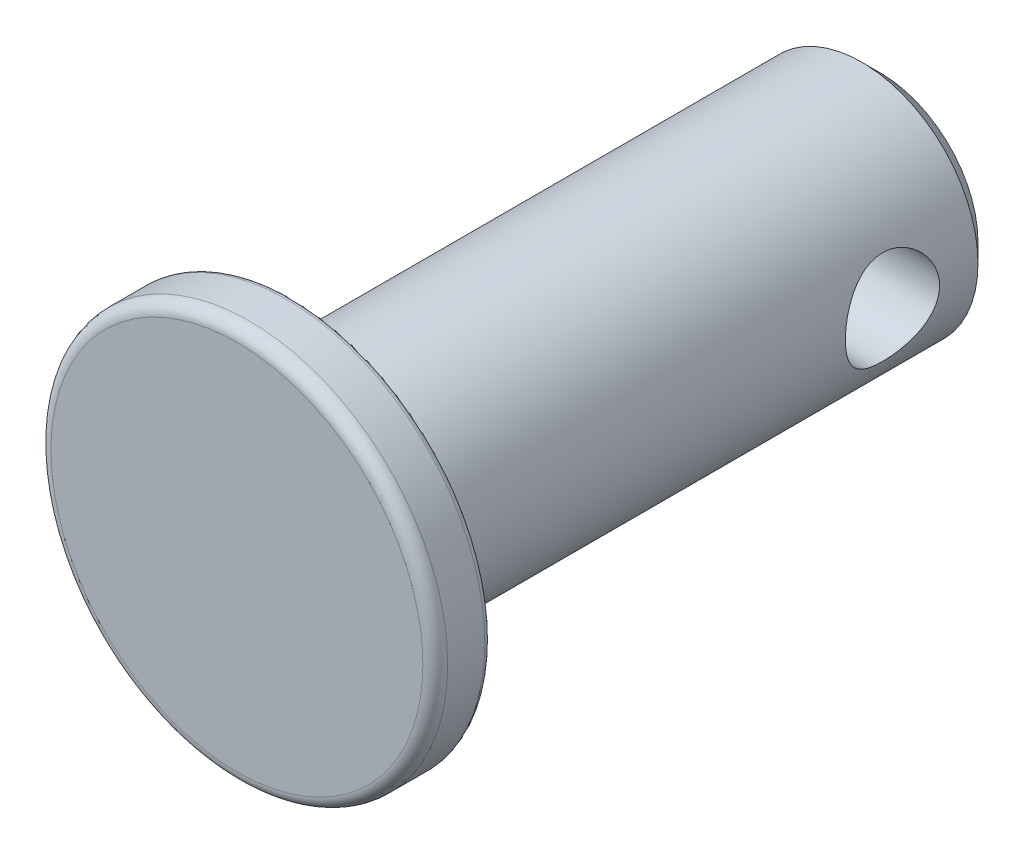
ISO-10303-21;
HEADER;
FILE_DESCRIPTION(('STEP AP214'),'2;1');
FILE_NAME('part.step','',(''),(''),'','','');
FILE_SCHEMA(('AUTOMOTIVE_DESIGN { 1 0 10303 214 1 1 1 1 }'));
ENDSEC;
DATA;
#1=APPLICATION_CONTEXT('core data for automotive mechanical design processes');
#2=APPLICATION_PROTOCOL_DEFINITION('international standard','automotive_design',2000,#1);
#3=PRODUCT_CONTEXT('',#1,'mechanical');
#4=PRODUCT('Part','Part','',(#3));
#5=PRODUCT_RELATED_PRODUCT_CATEGORY('part','',(#4));
#6=PRODUCT_DEFINITION_FORMATION('','',#4);
#7=PRODUCT_DEFINITION_CONTEXT('part definition',#1,'design');
#8=PRODUCT_DEFINITION('design','',#6,#7);
#9=PRODUCT_DEFINITION_SHAPE('','',#8);
#10=(LENGTH_UNIT() NAMED_UNIT(*) SI_UNIT(.MILLI.,.METRE.));
#11=(NAMED_UNIT(*) PLANE_ANGLE_UNIT() SI_UNIT($,.RADIAN.));
#12=(NAMED_UNIT(*) SI_UNIT($,.STERADIAN.) SOLID_ANGLE_UNIT());
#13=UNCERTAINTY_MEASURE_WITH_UNIT(LENGTH_MEASURE(1.E-05),#10,'distance_accuracy_value','');
#14=(GEOMETRIC_REPRESENTATION_CONTEXT(3) GLOBAL_UNCERTAINTY_ASSIGNED_CONTEXT((#13)) GLOBAL_UNIT_ASSIGNED_CONTEXT((#10,
#11,#12)) REPRESENTATION_CONTEXT('',''));
#15=CARTESIAN_POINT('',(0.,0.,0.));
#16=DIRECTION('',(0.,0.,1.));
#17=DIRECTION('',(1.,0.,0.));
#18=AXIS2_PLACEMENT_3D('',#15,#16,#17);
#19=CARTESIAN_POINT('',(0.,2.00025,-13.1826));
#20=DIRECTION('',(0.,0.,1.));
#21=DIRECTION('',(1.,0.,0.));
#22=AXIS2_PLACEMENT_3D('',#19,#20,#21);
#23=PLANE('',#22);
#24=CARTESIAN_POINT('',(0.,0.,-13.1826));
#25=DIRECTION('',(0.,0.,1.));
#26=DIRECTION('',(1.,0.,0.));
#27=AXIS2_PLACEMENT_3D('',#24,#25,#26);
#28=CIRCLE('',#27,2.00025);
#29=CARTESIAN_POINT('',(2.00025,0.,-13.1826));
#30=VERTEX_POINT('',#29);
#31=EDGE_CURVE('E10',#30,#30,#28,.T.);
#32=ORIENTED_EDGE('',*,*,#31,.F.);
#33=EDGE_LOOP('',(#32));
#34=FACE_BOUND('',#33,.T.);
#35=ADVANCED_FACE('F33',(#34),#23,.F.);
#36=CARTESIAN_POINT('',(0.,0.,-13.1826));
#37=DIRECTION('',(0.,0.,1.));
#38=DIRECTION('',(1.,0.,0.));
#39=AXIS2_PLACEMENT_3D('',#36,#37,#38);
#40=CONICAL_SURFACE('',#39,2.00025,0.785398163397444);
#41=CARTESIAN_POINT('',(0.,0.,-12.8016));
#42=DIRECTION('',(0.,0.,1.));
#43=DIRECTION('',(1.,0.,0.));
#44=AXIS2_PLACEMENT_3D('',#41,#42,#43);
#45=CIRCLE('',#44,2.38125);
#46=CARTESIAN_POINT('',(2.38125,0.,-12.8016));
#47=VERTEX_POINT('',#46);
#48=EDGE_CURVE('E44',#47,#47,#45,.T.);
#49=ORIENTED_EDGE('',*,*,#48,.F.);
#50=EDGE_LOOP('',(#49));
#51=FACE_BOUND('',#50,.T.);
#52=ORIENTED_EDGE('',*,*,#31,.T.);
#53=EDGE_LOOP('',(#52));
#54=FACE_BOUND('',#53,.T.);
#55=ADVANCED_FACE('F86',(#51,#54),#40,.T.);
#56=CARTESIAN_POINT('',(0.,0.,0.));
#57=DIRECTION('',(0.,0.,1.));
#58=DIRECTION('',(1.,0.,0.));
#59=AXIS2_PLACEMENT_3D('',#56,#57,#58);
#60=CYLINDRICAL_SURFACE('',#59,2.38125);
#61=CARTESIAN_POINT('',(2.38125,0.,-12.0142));
#62=CARTESIAN_POINT('',(2.38124624590175,-0.0518210382053978,-12.0141949517764));
#63=CARTESIAN_POINT('',(2.37953862731059,-0.103729436112291,-12.0100017706133));
#64=CARTESIAN_POINT('',(2.3728738253094,-0.206080518240613,-11.9933753608065));
#65=CARTESIAN_POINT('',(2.36790791780179,-0.256518886703153,-11.9809200091408));
#66=CARTESIAN_POINT('',(2.35526121134363,-0.354283584768344,-11.9482994041979));
#67=CARTESIAN_POINT('',(2.34758940656527,-0.40161961555618,-11.9281596752155));
#68=CARTESIAN_POINT('',(2.33028378662166,-0.492197276392704,-11.8808445685596));
#69=CARTESIAN_POINT('',(2.32065062515151,-0.535440263584572,-11.8536715341805));
#70=CARTESIAN_POINT('',(2.29987508141774,-0.618748585826784,-11.7916801422818));
#71=CARTESIAN_POINT('',(2.28868502638858,-0.658591261223401,-11.756578657185));
#72=CARTESIAN_POINT('',(2.26627097426914,-0.732013673683145,-11.6803246540273));
#73=CARTESIAN_POINT('',(2.25504696302302,-0.765590274210439,-11.6391691238966));
#74=CARTESIAN_POINT('',(2.23326093493031,-0.82704929436042,-11.549678792146));
#75=CARTESIAN_POINT('',(2.22275307603751,-0.854598960590427,-11.5011009168718));
#76=CARTESIAN_POINT('',(2.20433954001008,-0.901036883108096,-11.3995116595843));
#77=CARTESIAN_POINT('',(2.19643259432223,-0.919929363570347,-11.3465024547498));
#78=CARTESIAN_POINT('',(2.18462925902987,-0.947610074401603,-11.2401154536302));
#79=CARTESIAN_POINT('',(2.18056424883679,-0.956825330911763,-11.1868681683811));
#80=CARTESIAN_POINT('',(2.17641746595726,-0.96622344228668,-11.079439820847));
#81=CARTESIAN_POINT('',(2.176333661258,-0.966410904950634,-11.02525924904));
#82=CARTESIAN_POINT('',(2.18001527253027,-0.958071091253857,-10.9216523067326));
#83=CARTESIAN_POINT('',(2.18350472911839,-0.950168606073575,-10.8721639121311));
#84=CARTESIAN_POINT('',(2.19347551290143,-0.926916958610427,-10.7752875963432));
#85=CARTESIAN_POINT('',(2.19995737783281,-0.911566457892184,-10.7279000543587));
#86=CARTESIAN_POINT('',(2.21532637052303,-0.873559794308149,-10.6354098583437));
#87=CARTESIAN_POINT('',(2.22426050815925,-0.850758986918636,-10.590374803305));
#88=CARTESIAN_POINT('',(2.2435150970674,-0.798600704069739,-10.5046013827744));
#89=CARTESIAN_POINT('',(2.25383607700592,-0.769240725401364,-10.4638646664408));
#90=CARTESIAN_POINT('',(2.27570128290529,-0.702052747205628,-10.3844332121622));
#91=CARTESIAN_POINT('',(2.28727749772945,-0.663736848118594,-10.3461588483636));
#92=CARTESIAN_POINT('',(2.3096523112155,-0.581109560512275,-10.276442365179));
#93=CARTESIAN_POINT('',(2.32045074630751,-0.536796916464222,-10.2450016801514));
#94=CARTESIAN_POINT('',(2.34033707391717,-0.442214823481682,-10.1892731726511));
#95=CARTESIAN_POINT('',(2.34938476195424,-0.391840733286919,-10.1651475495016));
#96=CARTESIAN_POINT('',(2.36444478372068,-0.287289056954136,-10.1258585677915));
#97=CARTESIAN_POINT('',(2.37045870198489,-0.233113473210725,-10.1106905299851));
#98=CARTESIAN_POINT('',(2.37848250945635,-0.126016964187919,-10.0906068196855));
#99=CARTESIAN_POINT('',(2.38071260441107,-0.0732183868938993,-10.0851264635816));
#100=CARTESIAN_POINT('',(2.38161406218049,0.0325862309694611,-10.0829012078912));
#101=CARTESIAN_POINT('',(2.38028637824039,0.0855922121686297,-10.0861539684181));
#102=CARTESIAN_POINT('',(2.3743652143321,0.187720760105135,-10.1008907811476));
#103=CARTESIAN_POINT('',(2.36992613272682,0.236909395384178,-10.1119858807865));
#104=CARTESIAN_POINT('',(2.35839020661157,0.33267891720317,-10.141559372018));
#105=CARTESIAN_POINT('',(2.35129302229742,0.379259469457776,-10.1600387076104));
#106=CARTESIAN_POINT('',(2.33485556835556,0.47010481818846,-10.2044599622999));
#107=CARTESIAN_POINT('',(2.32545299891748,0.514254257758826,-10.2306140077234));
#108=CARTESIAN_POINT('',(2.30541923053941,0.597693873639044,-10.2894076924087));
#109=CARTESIAN_POINT('',(2.29478753285474,0.636982063913147,-10.3220499682984));
#110=CARTESIAN_POINT('',(2.27255738258299,0.712378304603479,-10.3954854128852));
#111=CARTESIAN_POINT('',(2.26094223562201,0.748090509419091,-10.4366809989766));
#112=CARTESIAN_POINT('',(2.23871453614992,0.81219638353513,-10.5246796687106));
#113=CARTESIAN_POINT('',(2.22810216794308,0.840588709139957,-10.5714837795923));
#114=CARTESIAN_POINT('',(2.20904943873814,0.889466789246226,-10.6701562172721));
#115=CARTESIAN_POINT('',(2.2006344162815,0.909861560195137,-10.722074859177));
#116=CARTESIAN_POINT('',(2.18730690807775,0.941456125989012,-10.8290549618117));
#117=CARTESIAN_POINT('',(2.18239174273414,0.952662956396699,-10.8841139832095));
#118=CARTESIAN_POINT('',(2.17701477743232,0.964882721071548,-10.9914460248046));
#119=CARTESIAN_POINT('',(2.1762518870111,0.966585100078926,-11.0436259162772));
#120=CARTESIAN_POINT('',(2.17847349413823,0.961567669998662,-11.1474925863154));
#121=CARTESIAN_POINT('',(2.18145748631174,0.954848996732241,-11.1991794304353));
#122=CARTESIAN_POINT('',(2.19056794905915,0.933748477882502,-11.2983805417065));
#123=CARTESIAN_POINT('',(2.19655819754716,0.919697849983162,-11.3459789279106));
#124=CARTESIAN_POINT('',(2.21090680755223,0.884646484807889,-11.4381593106269));
#125=CARTESIAN_POINT('',(2.21926582674855,0.863643817054651,-11.4827404651528));
#126=CARTESIAN_POINT('',(2.23801407721221,0.813873430810175,-11.5704496811983));
#127=CARTESIAN_POINT('',(2.24849316227831,0.784724879832282,-11.6133421061893));
#128=CARTESIAN_POINT('',(2.27003434342163,0.720039364012481,-11.69384304567));
#129=CARTESIAN_POINT('',(2.28109662297131,0.684500380166415,-11.7314498835129));
#130=CARTESIAN_POINT('',(2.30345289230364,0.605196812932526,-11.8029126213699));
#131=CARTESIAN_POINT('',(2.31471233396294,0.561039509223712,-11.8363454850213));
#132=CARTESIAN_POINT('',(2.3354369893526,0.467317198303179,-11.8953395030866));
#133=CARTESIAN_POINT('',(2.34490137456507,0.41774971054035,-11.920897025978));
#134=CARTESIAN_POINT('',(2.36081619829663,0.315482324678989,-11.9628285653094));
#135=CARTESIAN_POINT('',(2.36731790379847,0.262855021459222,-11.9793598589546));
#136=CARTESIAN_POINT('',(2.37678500072097,0.155348283311393,-12.0031958581518));
#137=CARTESIAN_POINT('',(2.37976156624452,0.10047653818498,-12.0105297223943));
#138=CARTESIAN_POINT('',(2.38110640468793,0.030309425145507,-12.0138445947642));
#139=CARTESIAN_POINT('',(2.38125109813143,0.015158450049683,-12.014201476683));
#140=CARTESIAN_POINT('',(2.38125,0.,-12.0142));
#141=B_SPLINE_CURVE_WITH_KNOTS('',3,(#61,#62,#63,#64,#65,#66,#67,#68,#69,#70,#71,#72,#73,#74,
#75,#76,#77,#78,#79,#80,#81,#82,#83,#84,#85,#86,#87,#88,#89,#90,#91,#92,#93,#94,#95,#96,#97,#98,
#99,#100,#101,#102,#103,#104,#105,#106,#107,#108,#109,#110,#111,#112,#113,#114,#115,#116,#117,
#118,#119,#120,#121,#122,#123,#124,#125,#126,#127,#128,#129,#130,#131,#132,#133,#134,#135,#136,
#137,#138,#139,#140),.UNSPECIFIED.,.T.,.F.,(4,2,2,2,2,2,2,2,2,2,2,2,2,2,2,2,2,2,2,2,2,2,2,2,2,2,
2,2,2,2,2,2,2,2,2,2,2,2,2,4),(0.,0.155421761841861,0.31126137438407,0.466587796583724,
0.6218625349677,0.783949879896352,0.946118142638776,1.11574195357222,1.28528291014832,
1.44698022835686,1.60859501514224,1.75860512853661,1.90864220928177,2.06178494183015,
2.21498621914027,2.38037725654166,2.54580297532447,2.71466597630662,2.88344068876277,
3.04200584808879,3.20052852687677,3.35169542702618,3.50288165851634,3.6587198601331,
3.81462151980572,3.98108654129476,4.1475820987123,4.31592034207303,4.4841295615932,
4.63996092650041,4.79577127532556,4.94508470463608,5.0944396308805,5.25248835040908,
5.41058709213523,5.57933065001162,5.74815190384725,5.91392917058102,6.07917953256211,
6.12464278638916),.UNSPECIFIED.);
#142=CARTESIAN_POINT('',(2.38125,0.,-12.0142));
#143=VERTEX_POINT('',#142);
#144=EDGE_CURVE('E36',#143,#143,#141,.T.);
#145=ORIENTED_EDGE('',*,*,#144,.T.);
#146=EDGE_LOOP('',(#145));
#147=FACE_BOUND('',#146,.T.);
#148=CARTESIAN_POINT('',(-2.38125,0.,-12.0142));
#149=CARTESIAN_POINT('',(-2.38124624590175,0.0518210382053978,-12.0141949517764));
#150=CARTESIAN_POINT('',(-2.37953862731059,0.103729436112291,-12.0100017706133));
#151=CARTESIAN_POINT('',(-2.3728738253094,0.206080518240613,-11.9933753608065));
#152=CARTESIAN_POINT('',(-2.36790791780179,0.256518886703153,-11.9809200091408));
#153=CARTESIAN_POINT('',(-2.35526121134363,0.354283584768344,-11.9482994041979));
#154=CARTESIAN_POINT('',(-2.34758940656527,0.40161961555618,-11.9281596752155));
#155=CARTESIAN_POINT('',(-2.33028378662166,0.492197276392704,-11.8808445685596));
#156=CARTESIAN_POINT('',(-2.32065062515151,0.535440263584572,-11.8536715341805));
#157=CARTESIAN_POINT('',(-2.29987508141774,0.618748585826784,-11.7916801422818));
#158=CARTESIAN_POINT('',(-2.28868502638858,0.658591261223401,-11.756578657185));
#159=CARTESIAN_POINT('',(-2.26627097426914,0.732013673683145,-11.6803246540273));
#160=CARTESIAN_POINT('',(-2.25504696302302,0.765590274210439,-11.6391691238966));
#161=CARTESIAN_POINT('',(-2.23326093493031,0.82704929436042,-11.549678792146));
#162=CARTESIAN_POINT('',(-2.22275307603751,0.854598960590427,-11.5011009168718));
#163=CARTESIAN_POINT('',(-2.20433954001008,0.901036883108096,-11.3995116595843));
#164=CARTESIAN_POINT('',(-2.19643259432223,0.919929363570347,-11.3465024547498));
#165=CARTESIAN_POINT('',(-2.18462925902987,0.947610074401603,-11.2401154536302));
#166=CARTESIAN_POINT('',(-2.18056424883679,0.956825330911763,-11.1868681683811));
#167=CARTESIAN_POINT('',(-2.17641746595726,0.96622344228668,-11.079439820847));
#168=CARTESIAN_POINT('',(-2.176333661258,0.966410904950634,-11.02525924904));
#169=CARTESIAN_POINT('',(-2.18001527253027,0.958071091253857,-10.9216523067326));
#170=CARTESIAN_POINT('',(-2.18350472911839,0.950168606073575,-10.8721639121311));
#171=CARTESIAN_POINT('',(-2.19347551290143,0.926916958610427,-10.7752875963432));
#172=CARTESIAN_POINT('',(-2.19995737783281,0.911566457892184,-10.7279000543587));
#173=CARTESIAN_POINT('',(-2.21532637052303,0.873559794308149,-10.6354098583437));
#174=CARTESIAN_POINT('',(-2.22426050815925,0.850758986918636,-10.590374803305));
#175=CARTESIAN_POINT('',(-2.2435150970674,0.798600704069739,-10.5046013827744));
#176=CARTESIAN_POINT('',(-2.25383607700592,0.769240725401364,-10.4638646664408));
#177=CARTESIAN_POINT('',(-2.27570128290529,0.702052747205628,-10.3844332121622));
#178=CARTESIAN_POINT('',(-2.28727749772945,0.663736848118594,-10.3461588483636));
#179=CARTESIAN_POINT('',(-2.3096523112155,0.581109560512275,-10.276442365179));
#180=CARTESIAN_POINT('',(-2.32045074630751,0.536796916464222,-10.2450016801514));
#181=CARTESIAN_POINT('',(-2.34033707391717,0.442214823481682,-10.1892731726511));
#182=CARTESIAN_POINT('',(-2.34938476195424,0.391840733286919,-10.1651475495016));
#183=CARTESIAN_POINT('',(-2.36444478372068,0.287289056954136,-10.1258585677915));
#184=CARTESIAN_POINT('',(-2.37045870198489,0.233113473210725,-10.1106905299851));
#185=CARTESIAN_POINT('',(-2.37848250945635,0.126016964187919,-10.0906068196855));
#186=CARTESIAN_POINT('',(-2.38071260441107,0.0732183868938993,-10.0851264635816));
#187=CARTESIAN_POINT('',(-2.38161406218049,-0.0325862309694611,-10.0829012078912));
#188=CARTESIAN_POINT('',(-2.38028637824039,-0.0855922121686297,-10.0861539684181));
#189=CARTESIAN_POINT('',(-2.3743652143321,-0.187720760105135,-10.1008907811476));
#190=CARTESIAN_POINT('',(-2.36992613272682,-0.236909395384178,-10.1119858807865));
#191=CARTESIAN_POINT('',(-2.35839020661157,-0.33267891720317,-10.141559372018));
#192=CARTESIAN_POINT('',(-2.35129302229742,-0.379259469457776,-10.1600387076104));
#193=CARTESIAN_POINT('',(-2.33485556835556,-0.47010481818846,-10.2044599622999));
#194=CARTESIAN_POINT('',(-2.32545299891748,-0.514254257758826,-10.2306140077234));
#195=CARTESIAN_POINT('',(-2.30541923053941,-0.597693873639044,-10.2894076924087));
#196=CARTESIAN_POINT('',(-2.29478753285474,-0.636982063913147,-10.3220499682984));
#197=CARTESIAN_POINT('',(-2.27255738258299,-0.712378304603479,-10.3954854128852));
#198=CARTESIAN_POINT('',(-2.26094223562201,-0.748090509419091,-10.4366809989766));
#199=CARTESIAN_POINT('',(-2.23871453614992,-0.81219638353513,-10.5246796687106));
#200=CARTESIAN_POINT('',(-2.22810216794308,-0.840588709139957,-10.5714837795923));
#201=CARTESIAN_POINT('',(-2.20904943873814,-0.889466789246226,-10.6701562172721));
#202=CARTESIAN_POINT('',(-2.2006344162815,-0.909861560195137,-10.722074859177));
#203=CARTESIAN_POINT('',(-2.18730690807775,-0.941456125989012,-10.8290549618117));
#204=CARTESIAN_POINT('',(-2.18239174273414,-0.952662956396699,-10.8841139832095));
#205=CARTESIAN_POINT('',(-2.17701477743232,-0.964882721071548,-10.9914460248046));
#206=CARTESIAN_POINT('',(-2.1762518870111,-0.966585100078926,-11.0436259162772));
#207=CARTESIAN_POINT('',(-2.17847349413823,-0.961567669998662,-11.1474925863154));
#208=CARTESIAN_POINT('',(-2.18145748631174,-0.954848996732241,-11.1991794304353));
#209=CARTESIAN_POINT('',(-2.19056794905915,-0.933748477882502,-11.2983805417065));
#210=CARTESIAN_POINT('',(-2.19655819754716,-0.919697849983162,-11.3459789279106));
#211=CARTESIAN_POINT('',(-2.21090680755223,-0.884646484807889,-11.4381593106269));
#212=CARTESIAN_POINT('',(-2.21926582674855,-0.863643817054651,-11.4827404651528));
#213=CARTESIAN_POINT('',(-2.23801407721221,-0.813873430810175,-11.5704496811983));
#214=CARTESIAN_POINT('',(-2.24849316227831,-0.784724879832282,-11.6133421061893));
#215=CARTESIAN_POINT('',(-2.27003434342163,-0.720039364012481,-11.69384304567));
#216=CARTESIAN_POINT('',(-2.28109662297131,-0.684500380166415,-11.7314498835129));
#217=CARTESIAN_POINT('',(-2.30345289230364,-0.605196812932526,-11.8029126213699));
#218=CARTESIAN_POINT('',(-2.31471233396294,-0.561039509223712,-11.8363454850213));
#219=CARTESIAN_POINT('',(-2.3354369893526,-0.467317198303179,-11.8953395030866));
#220=CARTESIAN_POINT('',(-2.34490137456507,-0.41774971054035,-11.920897025978));
#221=CARTESIAN_POINT('',(-2.36081619829663,-0.315482324678989,-11.9628285653094));
#222=CARTESIAN_POINT('',(-2.36731790379847,-0.262855021459222,-11.9793598589546));
#223=CARTESIAN_POINT('',(-2.37678500072097,-0.155348283311393,-12.0031958581518));
#224=CARTESIAN_POINT('',(-2.37976156624452,-0.10047653818498,-12.0105297223943));
#225=CARTESIAN_POINT('',(-2.38110640468793,-0.030309425145507,-12.0138445947642));
#226=CARTESIAN_POINT('',(-2.38125109813143,-0.015158450049683,-12.014201476683));
#227=CARTESIAN_POINT('',(-2.38125,0.,-12.0142));
#228=B_SPLINE_CURVE_WITH_KNOTS('',3,(#148,#149,#150,#151,#152,#153,#154,#155,#156,#157,#158,
#159,#160,#161,#162,#163,#164,#165,#166,#167,#168,#169,#170,#171,#172,#173,#174,#175,#176,#177,
#178,#179,#180,#181,#182,#183,#184,#185,#186,#187,#188,#189,#190,#191,#192,#193,#194,#195,#196,
#197,#198,#199,#200,#201,#202,#203,#204,#205,#206,#207,#208,#209,#210,#211,#212,#213,#214,#215,
#216,#217,#218,#219,#220,#221,#222,#223,#224,#225,#226,#227),.UNSPECIFIED.,.T.,.F.,(4,2,2,2,2,2,
2,2,2,2,2,2,2,2,2,2,2,2,2,2,2,2,2,2,2,2,2,2,2,2,2,2,2,2,2,2,2,2,2,4),(0.,0.155421761841861,
0.31126137438407,0.466587796583724,0.6218625349677,0.783949879896352,0.946118142638776,
1.11574195357222,1.28528291014832,1.44698022835686,1.60859501514224,1.75860512853661,
1.90864220928177,2.06178494183015,2.21498621914027,2.38037725654166,2.54580297532447,
2.71466597630662,2.88344068876277,3.04200584808879,3.20052852687677,3.35169542702618,
3.50288165851634,3.6587198601331,3.81462151980572,3.98108654129476,4.1475820987123,
4.31592034207303,4.4841295615932,4.63996092650041,4.79577127532556,4.94508470463608,
5.0944396308805,5.25248835040908,5.41058709213523,5.57933065001162,5.74815190384725,
5.91392917058102,6.07917953256211,6.12464278638916),.UNSPECIFIED.);
#229=CARTESIAN_POINT('',(-2.38125,0.,-12.0142));
#230=VERTEX_POINT('',#229);
#231=EDGE_CURVE('E52',#230,#230,#228,.T.);
#232=ORIENTED_EDGE('',*,*,#231,.T.);
#233=EDGE_LOOP('',(#232));
#234=FACE_BOUND('',#233,.T.);
#235=CARTESIAN_POINT('',(0.,0.,-1.143));
#236=DIRECTION('',(0.,0.,1.));
#237=DIRECTION('',(1.,0.,0.));
#238=AXIS2_PLACEMENT_3D('',#235,#236,#237);
#239=CIRCLE('',#238,2.38125);
#240=CARTESIAN_POINT('',(2.38125,0.,-1.143));
#241=VERTEX_POINT('',#240);
#242=EDGE_CURVE('E49',#241,#241,#239,.T.);
#243=ORIENTED_EDGE('',*,*,#242,.F.);
#244=EDGE_LOOP('',(#243));
#245=FACE_BOUND('',#244,.T.);
#246=ORIENTED_EDGE('',*,*,#48,.T.);
#247=EDGE_LOOP('',(#246));
#248=FACE_BOUND('',#247,.T.);
#249=ADVANCED_FACE('F56',(#147,#234,#245,#248),#60,.T.);
#250=CARTESIAN_POINT('',(0.,3.937,-1.143));
#251=DIRECTION('',(0.,0.,1.));
#252=DIRECTION('',(1.,0.,0.));
#253=AXIS2_PLACEMENT_3D('',#250,#251,#252);
#254=PLANE('',#253);
#255=CARTESIAN_POINT('',(0.,0.,-1.143));
#256=DIRECTION('',(0.,0.,1.));
#257=DIRECTION('',(1.,0.,0.));
#258=AXIS2_PLACEMENT_3D('',#255,#256,#257);
#259=CIRCLE('',#258,3.937);
#260=CARTESIAN_POINT('',(3.937,0.,-1.143));
#261=VERTEX_POINT('',#260);
#262=EDGE_CURVE('E149',#261,#261,#259,.T.);
#263=ORIENTED_EDGE('',*,*,#262,.F.);
#264=EDGE_LOOP('',(#263));
#265=FACE_BOUND('',#264,.T.);
#266=ORIENTED_EDGE('',*,*,#242,.T.);
#267=EDGE_LOOP('',(#266));
#268=FACE_BOUND('',#267,.T.);
#269=ADVANCED_FACE('F79',(#265,#268),#254,.F.);
#270=CARTESIAN_POINT('',(0.,0.,-1.016));
#271=DIRECTION('',(0.,0.,1.));
#272=DIRECTION('',(1.,0.,0.));
#273=AXIS2_PLACEMENT_3D('',#270,#271,#272);
#274=TOROIDAL_SURFACE('',#273,3.937,0.127);
#275=CARTESIAN_POINT('',(0.,0.,-1.016));
#276=DIRECTION('',(0.,0.,1.));
#277=DIRECTION('',(1.,0.,0.));
#278=AXIS2_PLACEMENT_3D('',#275,#276,#277);
#279=CIRCLE('',#278,4.064);
#280=CARTESIAN_POINT('',(4.064,0.,-1.016));
#281=VERTEX_POINT('',#280);
#282=EDGE_CURVE('E153',#281,#281,#279,.T.);
#283=ORIENTED_EDGE('',*,*,#282,.F.);
#284=EDGE_LOOP('',(#283));
#285=FACE_BOUND('',#284,.T.);
#286=ORIENTED_EDGE('',*,*,#262,.T.);
#287=EDGE_LOOP('',(#286));
#288=FACE_BOUND('',#287,.T.);
#289=ADVANCED_FACE('F76',(#285,#288),#274,.T.);
#290=CARTESIAN_POINT('',(0.,0.,0.));
#291=DIRECTION('',(0.,0.,1.));
#292=DIRECTION('',(1.,0.,0.));
#293=AXIS2_PLACEMENT_3D('',#290,#291,#292);
#294=CYLINDRICAL_SURFACE('',#293,4.064);
#295=CARTESIAN_POINT('',(0.,0.,-0.254));
#296=DIRECTION('',(0.,0.,1.));
#297=DIRECTION('',(1.,0.,0.));
#298=AXIS2_PLACEMENT_3D('',#295,#296,#297);
#299=CIRCLE('',#298,4.064);
#300=CARTESIAN_POINT('',(4.064,0.,-0.254));
#301=VERTEX_POINT('',#300);
#302=EDGE_CURVE('E158',#301,#301,#299,.T.);
#303=ORIENTED_EDGE('',*,*,#302,.F.);
#304=EDGE_LOOP('',(#303));
#305=FACE_BOUND('',#304,.T.);
#306=ORIENTED_EDGE('',*,*,#282,.T.);
#307=EDGE_LOOP('',(#306));
#308=FACE_BOUND('',#307,.T.);
#309=ADVANCED_FACE('F72',(#305,#308),#294,.T.);
#310=CARTESIAN_POINT('',(0.,0.,-0.254));
#311=DIRECTION('',(0.,0.,1.));
#312=DIRECTION('',(1.,0.,0.));
#313=AXIS2_PLACEMENT_3D('',#310,#311,#312);
#314=TOROIDAL_SURFACE('',#313,3.81,0.254);
#315=CARTESIAN_POINT('',(0.,0.,0.));
#316=DIRECTION('',(0.,0.,1.));
#317=DIRECTION('',(1.,0.,0.));
#318=AXIS2_PLACEMENT_3D('',#315,#316,#317);
#319=CIRCLE('',#318,3.81);
#320=CARTESIAN_POINT('',(3.81,0.,0.));
#321=VERTEX_POINT('',#320);
#322=EDGE_CURVE('E161',#321,#321,#319,.T.);
#323=ORIENTED_EDGE('',*,*,#322,.F.);
#324=EDGE_LOOP('',(#323));
#325=FACE_BOUND('',#324,.T.);
#326=ORIENTED_EDGE('',*,*,#302,.T.);
#327=EDGE_LOOP('',(#326));
#328=FACE_BOUND('',#327,.T.);
#329=ADVANCED_FACE('F68',(#325,#328),#314,.T.);
#330=CARTESIAN_POINT('',(0.,0.,0.));
#331=DIRECTION('',(0.,0.,-1.));
#332=DIRECTION('',(-1.,0.,0.));
#333=AXIS2_PLACEMENT_3D('',#330,#331,#332);
#334=PLANE('',#333);
#335=ORIENTED_EDGE('',*,*,#322,.T.);
#336=EDGE_LOOP('',(#335));
#337=FACE_BOUND('',#336,.T.);
#338=ADVANCED_FACE('F63',(#337),#334,.F.);
#339=CARTESIAN_POINT('',(-4.064,0.,-11.049));
#340=DIRECTION('',(1.,0.,0.));
#341=DIRECTION('',(0.,0.,-1.));
#342=AXIS2_PLACEMENT_3D('',#339,#340,#341);
#343=CYLINDRICAL_SURFACE('',#342,0.965199999999996);
#344=ORIENTED_EDGE('',*,*,#231,.F.);
#345=EDGE_LOOP('',(#344));
#346=FACE_BOUND('',#345,.T.);
#347=ORIENTED_EDGE('',*,*,#144,.F.);
#348=EDGE_LOOP('',(#347));
#349=FACE_BOUND('',#348,.T.);
#350=ADVANCED_FACE('F59',(#346,#349),#343,.F.);
#351=CLOSED_SHELL('',(#35,#55,#249,#269,#289,#309,#329,#338,#350));
#352=MANIFOLD_SOLID_BREP('B2',#351);
#353=ADVANCED_BREP_SHAPE_REPRESENTATION('',(#18,#352),#14);
#354=SHAPE_DEFINITION_REPRESENTATION(#9,#353);
ENDSEC;
END-ISO-10303-21;
